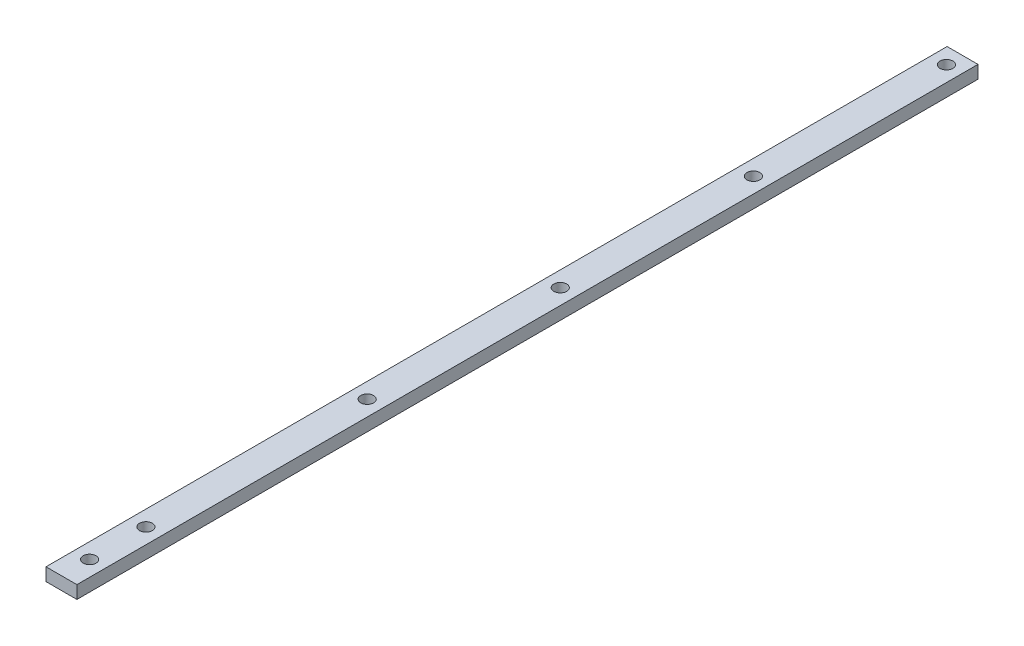
ISO-10303-21;
HEADER;
FILE_DESCRIPTION(('STEP AP214'),'2;1');
FILE_NAME('part.step','',(''),(''),'','','');
FILE_SCHEMA(('AUTOMOTIVE_DESIGN { 1 0 10303 214 1 1 1 1 }'));
ENDSEC;
DATA;
#1=APPLICATION_CONTEXT('core data for automotive mechanical design processes');
#2=APPLICATION_PROTOCOL_DEFINITION('international standard','automotive_design',2000,#1);
#3=PRODUCT_CONTEXT('',#1,'mechanical');
#4=PRODUCT('Part','Part','',(#3));
#5=PRODUCT_RELATED_PRODUCT_CATEGORY('part','',(#4));
#6=PRODUCT_DEFINITION_FORMATION('','',#4);
#7=PRODUCT_DEFINITION_CONTEXT('part definition',#1,'design');
#8=PRODUCT_DEFINITION('design','',#6,#7);
#9=PRODUCT_DEFINITION_SHAPE('','',#8);
#10=(LENGTH_UNIT() NAMED_UNIT(*) SI_UNIT(.MILLI.,.METRE.));
#11=(NAMED_UNIT(*) PLANE_ANGLE_UNIT() SI_UNIT($,.RADIAN.));
#12=(NAMED_UNIT(*) SI_UNIT($,.STERADIAN.) SOLID_ANGLE_UNIT());
#13=UNCERTAINTY_MEASURE_WITH_UNIT(LENGTH_MEASURE(1.E-05),#10,'distance_accuracy_value','');
#14=(GEOMETRIC_REPRESENTATION_CONTEXT(3) GLOBAL_UNCERTAINTY_ASSIGNED_CONTEXT((#13)) GLOBAL_UNIT_ASSIGNED_CONTEXT((#10,
#11,#12)) REPRESENTATION_CONTEXT('',''));
#15=CARTESIAN_POINT('',(0.,0.,0.));
#16=DIRECTION('',(0.,0.,1.));
#17=DIRECTION('',(1.,0.,0.));
#18=AXIS2_PLACEMENT_3D('',#15,#16,#17);
#19=CARTESIAN_POINT('',(-56.5626148851493,0.100000000000044,-41.4745215954879));
#20=DIRECTION('',(0.,-1.,0.));
#21=DIRECTION('',(-1.,0.,0.));
#22=AXIS2_PLACEMENT_3D('',#19,#20,#21);
#23=CYLINDRICAL_SURFACE('',#22,1.);
#24=CARTESIAN_POINT('',(-56.5626148851493,2.10000000000004,-41.4745215954879));
#25=DIRECTION('',(0.,-1.,0.));
#26=DIRECTION('',(-1.,0.,0.));
#27=AXIS2_PLACEMENT_3D('',#24,#25,#26);
#28=CIRCLE('',#27,1.);
#29=CARTESIAN_POINT('',(-55.5626148851493,2.10000000000004,-41.4745215954879));
#30=VERTEX_POINT('',#29);
#31=EDGE_CURVE('E33',#30,#30,#28,.T.);
#32=ORIENTED_EDGE('',*,*,#31,.F.);
#33=EDGE_LOOP('',(#32));
#34=FACE_BOUND('',#33,.T.);
#35=CARTESIAN_POINT('',(-56.5626148851493,0.100000000000044,-41.4745215954879));
#36=DIRECTION('',(0.,-1.,0.));
#37=DIRECTION('',(-1.,0.,0.));
#38=AXIS2_PLACEMENT_3D('',#35,#36,#37);
#39=CIRCLE('',#38,1.);
#40=CARTESIAN_POINT('',(-55.5626148851493,0.100000000000044,-41.4745215954879));
#41=VERTEX_POINT('',#40);
#42=EDGE_CURVE('E11',#41,#41,#39,.T.);
#43=ORIENTED_EDGE('',*,*,#42,.T.);
#44=EDGE_LOOP('',(#43));
#45=FACE_BOUND('',#44,.T.);
#46=ADVANCED_FACE('F16',(#34,#45),#23,.F.);
#47=CARTESIAN_POINT('',(-56.5626148851493,0.100000000000044,-32.7245215954879));
#48=DIRECTION('',(0.,-1.,0.));
#49=DIRECTION('',(-1.,0.,0.));
#50=AXIS2_PLACEMENT_3D('',#47,#48,#49);
#51=CYLINDRICAL_SURFACE('',#50,1.);
#52=CARTESIAN_POINT('',(-56.5626148851493,2.10000000000004,-32.7245215954879));
#53=DIRECTION('',(0.,-1.,0.));
#54=DIRECTION('',(-1.,0.,0.));
#55=AXIS2_PLACEMENT_3D('',#52,#53,#54);
#56=CIRCLE('',#55,1.);
#57=CARTESIAN_POINT('',(-55.5626148851493,2.10000000000004,-32.7245215954879));
#58=VERTEX_POINT('',#57);
#59=EDGE_CURVE('E129',#58,#58,#56,.T.);
#60=ORIENTED_EDGE('',*,*,#59,.F.);
#61=EDGE_LOOP('',(#60));
#62=FACE_BOUND('',#61,.T.);
#63=CARTESIAN_POINT('',(-56.5626148851493,0.100000000000044,-32.7245215954879));
#64=DIRECTION('',(0.,-1.,0.));
#65=DIRECTION('',(-1.,0.,0.));
#66=AXIS2_PLACEMENT_3D('',#63,#64,#65);
#67=CIRCLE('',#66,1.);
#68=CARTESIAN_POINT('',(-55.5626148851493,0.100000000000044,-32.7245215954879));
#69=VERTEX_POINT('',#68);
#70=EDGE_CURVE('E26',#69,#69,#67,.T.);
#71=ORIENTED_EDGE('',*,*,#70,.T.);
#72=EDGE_LOOP('',(#71));
#73=FACE_BOUND('',#72,.T.);
#74=ADVANCED_FACE('F184',(#62,#73),#51,.F.);
#75=CARTESIAN_POINT('',(-56.5626148851493,0.100000000000044,-75.849521595488));
#76=DIRECTION('',(0.,-1.,0.));
#77=DIRECTION('',(-1.,0.,0.));
#78=AXIS2_PLACEMENT_3D('',#75,#76,#77);
#79=CYLINDRICAL_SURFACE('',#78,1.);
#80=CARTESIAN_POINT('',(-56.5626148851493,2.10000000000004,-75.849521595488));
#81=DIRECTION('',(0.,-1.,0.));
#82=DIRECTION('',(-1.,0.,0.));
#83=AXIS2_PLACEMENT_3D('',#80,#81,#82);
#84=CIRCLE('',#83,1.);
#85=CARTESIAN_POINT('',(-55.5626148851493,2.10000000000004,-75.849521595488));
#86=VERTEX_POINT('',#85);
#87=EDGE_CURVE('E126',#86,#86,#84,.T.);
#88=ORIENTED_EDGE('',*,*,#87,.F.);
#89=EDGE_LOOP('',(#88));
#90=FACE_BOUND('',#89,.T.);
#91=CARTESIAN_POINT('',(-56.5626148851493,0.100000000000044,-75.849521595488));
#92=DIRECTION('',(0.,-1.,0.));
#93=DIRECTION('',(-1.,0.,0.));
#94=AXIS2_PLACEMENT_3D('',#91,#92,#93);
#95=CIRCLE('',#94,1.);
#96=CARTESIAN_POINT('',(-55.5626148851493,0.100000000000044,-75.849521595488));
#97=VERTEX_POINT('',#96);
#98=EDGE_CURVE('E91',#97,#97,#95,.T.);
#99=ORIENTED_EDGE('',*,*,#98,.T.);
#100=EDGE_LOOP('',(#99));
#101=FACE_BOUND('',#100,.T.);
#102=ADVANCED_FACE('F189',(#90,#101),#79,.F.);
#103=CARTESIAN_POINT('',(-56.5626148851493,0.100000000000044,-105.849521595488));
#104=DIRECTION('',(0.,-1.,0.));
#105=DIRECTION('',(-1.,0.,0.));
#106=AXIS2_PLACEMENT_3D('',#103,#104,#105);
#107=CYLINDRICAL_SURFACE('',#106,1.);
#108=CARTESIAN_POINT('',(-56.5626148851493,2.10000000000004,-105.849521595488));
#109=DIRECTION('',(0.,-1.,0.));
#110=DIRECTION('',(-1.,0.,0.));
#111=AXIS2_PLACEMENT_3D('',#108,#109,#110);
#112=CIRCLE('',#111,1.);
#113=CARTESIAN_POINT('',(-55.5626148851493,2.10000000000004,-105.849521595488));
#114=VERTEX_POINT('',#113);
#115=EDGE_CURVE('E103',#114,#114,#112,.T.);
#116=ORIENTED_EDGE('',*,*,#115,.F.);
#117=EDGE_LOOP('',(#116));
#118=FACE_BOUND('',#117,.T.);
#119=CARTESIAN_POINT('',(-56.5626148851493,0.100000000000044,-105.849521595488));
#120=DIRECTION('',(0.,-1.,0.));
#121=DIRECTION('',(-1.,0.,0.));
#122=AXIS2_PLACEMENT_3D('',#119,#120,#121);
#123=CIRCLE('',#122,1.);
#124=CARTESIAN_POINT('',(-55.5626148851493,0.100000000000044,-105.849521595488));
#125=VERTEX_POINT('',#124);
#126=EDGE_CURVE('E94',#125,#125,#123,.T.);
#127=ORIENTED_EDGE('',*,*,#126,.T.);
#128=EDGE_LOOP('',(#127));
#129=FACE_BOUND('',#128,.T.);
#130=ADVANCED_FACE('F197',(#118,#129),#107,.F.);
#131=CARTESIAN_POINT('',(-56.5626148851493,0.100000000000044,-165.849521595488));
#132=DIRECTION('',(0.,-1.,0.));
#133=DIRECTION('',(-1.,0.,0.));
#134=AXIS2_PLACEMENT_3D('',#131,#132,#133);
#135=CYLINDRICAL_SURFACE('',#134,1.);
#136=CARTESIAN_POINT('',(-56.5626148851493,2.10000000000004,-165.849521595488));
#137=DIRECTION('',(0.,-1.,0.));
#138=DIRECTION('',(-1.,0.,0.));
#139=AXIS2_PLACEMENT_3D('',#136,#137,#138);
#140=CIRCLE('',#139,1.);
#141=CARTESIAN_POINT('',(-55.5626148851493,2.10000000000004,-165.849521595488));
#142=VERTEX_POINT('',#141);
#143=EDGE_CURVE('E100',#142,#142,#140,.T.);
#144=ORIENTED_EDGE('',*,*,#143,.F.);
#145=EDGE_LOOP('',(#144));
#146=FACE_BOUND('',#145,.T.);
#147=CARTESIAN_POINT('',(-56.5626148851493,0.100000000000044,-165.849521595488));
#148=DIRECTION('',(0.,-1.,0.));
#149=DIRECTION('',(-1.,0.,0.));
#150=AXIS2_PLACEMENT_3D('',#147,#148,#149);
#151=CIRCLE('',#150,1.);
#152=CARTESIAN_POINT('',(-55.5626148851493,0.100000000000044,-165.849521595488));
#153=VERTEX_POINT('',#152);
#154=EDGE_CURVE('E64',#153,#153,#151,.T.);
#155=ORIENTED_EDGE('',*,*,#154,.T.);
#156=EDGE_LOOP('',(#155));
#157=FACE_BOUND('',#156,.T.);
#158=ADVANCED_FACE('F180',(#146,#157),#135,.F.);
#159=CARTESIAN_POINT('',(-56.5626148851493,0.100000000000044,-135.849521595488));
#160=DIRECTION('',(0.,-1.,0.));
#161=DIRECTION('',(-1.,0.,0.));
#162=AXIS2_PLACEMENT_3D('',#159,#160,#161);
#163=CYLINDRICAL_SURFACE('',#162,1.);
#164=CARTESIAN_POINT('',(-56.5626148851493,2.10000000000004,-135.849521595488));
#165=DIRECTION('',(0.,-1.,0.));
#166=DIRECTION('',(-1.,0.,0.));
#167=AXIS2_PLACEMENT_3D('',#164,#165,#166);
#168=CIRCLE('',#167,1.);
#169=CARTESIAN_POINT('',(-55.5626148851493,2.10000000000004,-135.849521595488));
#170=VERTEX_POINT('',#169);
#171=EDGE_CURVE('E69',#170,#170,#168,.T.);
#172=ORIENTED_EDGE('',*,*,#171,.F.);
#173=EDGE_LOOP('',(#172));
#174=FACE_BOUND('',#173,.T.);
#175=CARTESIAN_POINT('',(-56.5626148851493,0.100000000000044,-135.849521595488));
#176=DIRECTION('',(0.,-1.,0.));
#177=DIRECTION('',(-1.,0.,0.));
#178=AXIS2_PLACEMENT_3D('',#175,#176,#177);
#179=CIRCLE('',#178,1.);
#180=CARTESIAN_POINT('',(-55.5626148851493,0.100000000000044,-135.849521595488));
#181=VERTEX_POINT('',#180);
#182=EDGE_CURVE('E110',#181,#181,#179,.T.);
#183=ORIENTED_EDGE('',*,*,#182,.T.);
#184=EDGE_LOOP('',(#183));
#185=FACE_BOUND('',#184,.T.);
#186=ADVANCED_FACE('F172',(#174,#185),#163,.F.);
#187=CARTESIAN_POINT('',(-54.1626148851493,0.100000000000045,-28.3495215954879));
#188=DIRECTION('',(1.,0.,0.));
#189=DIRECTION('',(0.,0.,-1.));
#190=AXIS2_PLACEMENT_3D('',#187,#188,#189);
#191=PLANE('',#190);
#192=DIRECTION('',(0.,0.,1.));
#193=VECTOR('',#192,1.);
#194=CARTESIAN_POINT('',(-54.1626148851493,0.100000000000045,-168.349521595488));
#195=LINE('',#194,#193);
#196=CARTESIAN_POINT('',(-54.1626148851493,0.100000000000045,-168.349521595488));
#197=VERTEX_POINT('',#196);
#198=CARTESIAN_POINT('',(-54.1626148851493,0.100000000000045,-28.3495215954879));
#199=VERTEX_POINT('',#198);
#200=EDGE_CURVE('E136',#197,#199,#195,.T.);
#201=ORIENTED_EDGE('',*,*,#200,.F.);
#202=DIRECTION('',(0.,1.,0.));
#203=VECTOR('',#202,1.);
#204=CARTESIAN_POINT('',(-54.1626148851493,0.100000000000045,-168.349521595488));
#205=LINE('',#204,#203);
#206=CARTESIAN_POINT('',(-54.1626148851493,2.10000000000004,-168.349521595488));
#207=VERTEX_POINT('',#206);
#208=EDGE_CURVE('E107',#197,#207,#205,.T.);
#209=ORIENTED_EDGE('',*,*,#208,.T.);
#210=DIRECTION('',(0.,0.,-1.));
#211=VECTOR('',#210,1.);
#212=CARTESIAN_POINT('',(-54.1626148851493,2.10000000000004,-168.349521595488));
#213=LINE('',#212,#211);
#214=CARTESIAN_POINT('',(-54.1626148851493,2.10000000000004,-28.3495215954879));
#215=VERTEX_POINT('',#214);
#216=EDGE_CURVE('E123',#215,#207,#213,.T.);
#217=ORIENTED_EDGE('',*,*,#216,.F.);
#218=DIRECTION('',(0.,1.,0.));
#219=VECTOR('',#218,1.);
#220=CARTESIAN_POINT('',(-54.1626148851493,0.100000000000045,-28.3495215954879));
#221=LINE('',#220,#219);
#222=EDGE_CURVE('E20',#199,#215,#221,.T.);
#223=ORIENTED_EDGE('',*,*,#222,.F.);
#224=EDGE_LOOP('',(#201,#209,#217,#223));
#225=FACE_BOUND('',#224,.T.);
#226=ADVANCED_FACE('F170',(#225),#191,.T.);
#227=CARTESIAN_POINT('',(-58.9626148851493,0.100000000000042,-28.3495215954879));
#228=DIRECTION('',(0.,0.,1.));
#229=DIRECTION('',(1.,0.,0.));
#230=AXIS2_PLACEMENT_3D('',#227,#228,#229);
#231=PLANE('',#230);
#232=DIRECTION('',(-1.,0.,0.));
#233=VECTOR('',#232,1.);
#234=CARTESIAN_POINT('',(-54.1626148851493,0.100000000000045,-28.3495215954879));
#235=LINE('',#234,#233);
#236=CARTESIAN_POINT('',(-58.9626148851493,0.100000000000042,-28.3495215954879));
#237=VERTEX_POINT('',#236);
#238=EDGE_CURVE('E117',#199,#237,#235,.T.);
#239=ORIENTED_EDGE('',*,*,#238,.F.);
#240=ORIENTED_EDGE('',*,*,#222,.T.);
#241=DIRECTION('',(1.,0.,0.));
#242=VECTOR('',#241,1.);
#243=CARTESIAN_POINT('',(-54.1626148851493,2.10000000000004,-28.3495215954879));
#244=LINE('',#243,#242);
#245=CARTESIAN_POINT('',(-58.9626148851493,2.10000000000004,-28.3495215954879));
#246=VERTEX_POINT('',#245);
#247=EDGE_CURVE('E122',#246,#215,#244,.T.);
#248=ORIENTED_EDGE('',*,*,#247,.F.);
#249=DIRECTION('',(0.,1.,0.));
#250=VECTOR('',#249,1.);
#251=CARTESIAN_POINT('',(-58.9626148851493,0.100000000000042,-28.3495215954879));
#252=LINE('',#251,#250);
#253=EDGE_CURVE('E111',#237,#246,#252,.T.);
#254=ORIENTED_EDGE('',*,*,#253,.F.);
#255=EDGE_LOOP('',(#239,#240,#248,#254));
#256=FACE_BOUND('',#255,.T.);
#257=ADVANCED_FACE('F168',(#256),#231,.T.);
#258=CARTESIAN_POINT('',(-58.9626148851493,0.100000000000042,-168.349521595488));
#259=DIRECTION('',(-1.,0.,0.));
#260=DIRECTION('',(0.,0.,1.));
#261=AXIS2_PLACEMENT_3D('',#258,#259,#260);
#262=PLANE('',#261);
#263=DIRECTION('',(0.,0.,-1.));
#264=VECTOR('',#263,1.);
#265=CARTESIAN_POINT('',(-58.9626148851493,0.100000000000042,-28.3495215954879));
#266=LINE('',#265,#264);
#267=CARTESIAN_POINT('',(-58.9626148851493,0.100000000000042,-168.349521595488));
#268=VERTEX_POINT('',#267);
#269=EDGE_CURVE('E114',#237,#268,#266,.T.);
#270=ORIENTED_EDGE('',*,*,#269,.F.);
#271=ORIENTED_EDGE('',*,*,#253,.T.);
#272=DIRECTION('',(0.,0.,1.));
#273=VECTOR('',#272,1.);
#274=CARTESIAN_POINT('',(-58.9626148851493,2.10000000000004,-28.3495215954879));
#275=LINE('',#274,#273);
#276=CARTESIAN_POINT('',(-58.9626148851493,2.10000000000004,-168.349521595488));
#277=VERTEX_POINT('',#276);
#278=EDGE_CURVE('E118',#277,#246,#275,.T.);
#279=ORIENTED_EDGE('',*,*,#278,.F.);
#280=DIRECTION('',(0.,1.,0.));
#281=VECTOR('',#280,1.);
#282=CARTESIAN_POINT('',(-58.9626148851493,0.100000000000042,-168.349521595488));
#283=LINE('',#282,#281);
#284=EDGE_CURVE('E98',#268,#277,#283,.T.);
#285=ORIENTED_EDGE('',*,*,#284,.F.);
#286=EDGE_LOOP('',(#270,#271,#279,#285));
#287=FACE_BOUND('',#286,.T.);
#288=ADVANCED_FACE('F163',(#287),#262,.T.);
#289=CARTESIAN_POINT('',(-54.1626148851493,0.100000000000045,-168.349521595488));
#290=DIRECTION('',(0.,0.,-1.));
#291=DIRECTION('',(-1.,0.,0.));
#292=AXIS2_PLACEMENT_3D('',#289,#290,#291);
#293=PLANE('',#292);
#294=DIRECTION('',(1.,0.,0.));
#295=VECTOR('',#294,1.);
#296=CARTESIAN_POINT('',(-58.9626148851493,0.100000000000042,-168.349521595488));
#297=LINE('',#296,#295);
#298=EDGE_CURVE('E124',#268,#197,#297,.T.);
#299=ORIENTED_EDGE('',*,*,#298,.F.);
#300=ORIENTED_EDGE('',*,*,#284,.T.);
#301=DIRECTION('',(-1.,0.,0.));
#302=VECTOR('',#301,1.);
#303=CARTESIAN_POINT('',(-58.9626148851493,2.10000000000004,-168.349521595488));
#304=LINE('',#303,#302);
#305=EDGE_CURVE('E121',#207,#277,#304,.T.);
#306=ORIENTED_EDGE('',*,*,#305,.F.);
#307=ORIENTED_EDGE('',*,*,#208,.F.);
#308=EDGE_LOOP('',(#299,#300,#306,#307));
#309=FACE_BOUND('',#308,.T.);
#310=ADVANCED_FACE('F18',(#309),#293,.T.);
#311=CARTESIAN_POINT('',(-56.5626148851493,2.10000000000004,-98.349521595488));
#312=DIRECTION('',(0.,1.,0.));
#313=DIRECTION('',(-1.,0.,0.));
#314=AXIS2_PLACEMENT_3D('',#311,#312,#313);
#315=PLANE('',#314);
#316=ORIENTED_EDGE('',*,*,#171,.T.);
#317=EDGE_LOOP('',(#316));
#318=FACE_BOUND('',#317,.T.);
#319=ORIENTED_EDGE('',*,*,#143,.T.);
#320=EDGE_LOOP('',(#319));
#321=FACE_BOUND('',#320,.T.);
#322=ORIENTED_EDGE('',*,*,#115,.T.);
#323=EDGE_LOOP('',(#322));
#324=FACE_BOUND('',#323,.T.);
#325=ORIENTED_EDGE('',*,*,#87,.T.);
#326=EDGE_LOOP('',(#325));
#327=FACE_BOUND('',#326,.T.);
#328=ORIENTED_EDGE('',*,*,#59,.T.);
#329=EDGE_LOOP('',(#328));
#330=FACE_BOUND('',#329,.T.);
#331=ORIENTED_EDGE('',*,*,#31,.T.);
#332=EDGE_LOOP('',(#331));
#333=FACE_BOUND('',#332,.T.);
#334=ORIENTED_EDGE('',*,*,#305,.T.);
#335=ORIENTED_EDGE('',*,*,#278,.T.);
#336=ORIENTED_EDGE('',*,*,#247,.T.);
#337=ORIENTED_EDGE('',*,*,#216,.T.);
#338=EDGE_LOOP('',(#334,#335,#336,#337));
#339=FACE_BOUND('',#338,.T.);
#340=ADVANCED_FACE('F154',(#318,#321,#324,#327,#330,#333,#339),#315,.T.);
#341=CARTESIAN_POINT('',(-56.5626148851493,0.100000000000044,-98.349521595488));
#342=DIRECTION('',(0.,1.,0.));
#343=DIRECTION('',(-1.,0.,0.));
#344=AXIS2_PLACEMENT_3D('',#341,#342,#343);
#345=PLANE('',#344);
#346=ORIENTED_EDGE('',*,*,#182,.F.);
#347=EDGE_LOOP('',(#346));
#348=FACE_BOUND('',#347,.T.);
#349=ORIENTED_EDGE('',*,*,#154,.F.);
#350=EDGE_LOOP('',(#349));
#351=FACE_BOUND('',#350,.T.);
#352=ORIENTED_EDGE('',*,*,#126,.F.);
#353=EDGE_LOOP('',(#352));
#354=FACE_BOUND('',#353,.T.);
#355=ORIENTED_EDGE('',*,*,#98,.F.);
#356=EDGE_LOOP('',(#355));
#357=FACE_BOUND('',#356,.T.);
#358=ORIENTED_EDGE('',*,*,#70,.F.);
#359=EDGE_LOOP('',(#358));
#360=FACE_BOUND('',#359,.T.);
#361=ORIENTED_EDGE('',*,*,#42,.F.);
#362=EDGE_LOOP('',(#361));
#363=FACE_BOUND('',#362,.T.);
#364=ORIENTED_EDGE('',*,*,#298,.T.);
#365=ORIENTED_EDGE('',*,*,#200,.T.);
#366=ORIENTED_EDGE('',*,*,#238,.T.);
#367=ORIENTED_EDGE('',*,*,#269,.T.);
#368=EDGE_LOOP('',(#364,#365,#366,#367));
#369=FACE_BOUND('',#368,.T.);
#370=ADVANCED_FACE('F88',(#348,#351,#354,#357,#360,#363,#369),#345,.F.);
#371=CLOSED_SHELL('',(#46,#74,#102,#130,#158,#186,#226,#257,#288,#310,#340,#370));
#372=MANIFOLD_SOLID_BREP('B1',#371);
#373=ADVANCED_BREP_SHAPE_REPRESENTATION('',(#18,#372),#14);
#374=SHAPE_DEFINITION_REPRESENTATION(#9,#373);
ENDSEC;
END-ISO-10303-21;
